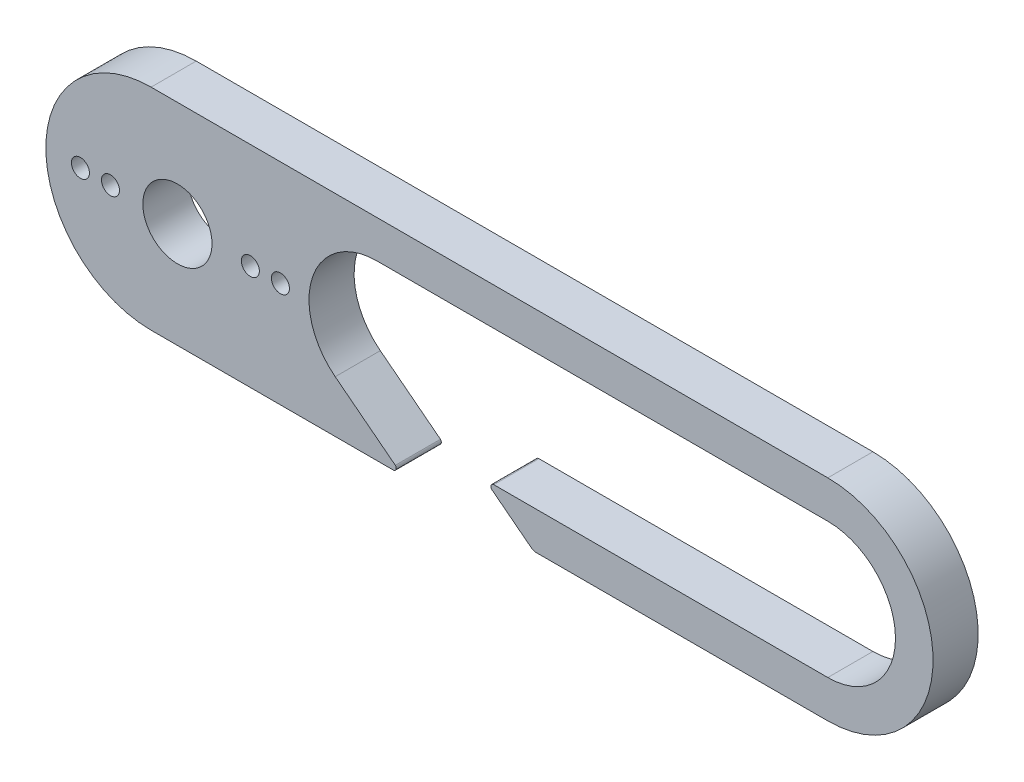
ISO-10303-21;
HEADER;
FILE_DESCRIPTION(('STEP AP214'),'2;1');
FILE_NAME('part.step','',(''),(''),'','','');
FILE_SCHEMA(('AUTOMOTIVE_DESIGN { 1 0 10303 214 1 1 1 1 }'));
ENDSEC;
DATA;
#1=APPLICATION_CONTEXT('core data for automotive mechanical design processes');
#2=APPLICATION_PROTOCOL_DEFINITION('international standard','automotive_design',2000,#1);
#3=PRODUCT_CONTEXT('',#1,'mechanical');
#4=PRODUCT('Part','Part','',(#3));
#5=PRODUCT_RELATED_PRODUCT_CATEGORY('part','',(#4));
#6=PRODUCT_DEFINITION_FORMATION('','',#4);
#7=PRODUCT_DEFINITION_CONTEXT('part definition',#1,'design');
#8=PRODUCT_DEFINITION('design','',#6,#7);
#9=PRODUCT_DEFINITION_SHAPE('','',#8);
#10=(LENGTH_UNIT() NAMED_UNIT(*) SI_UNIT(.MILLI.,.METRE.));
#11=(NAMED_UNIT(*) PLANE_ANGLE_UNIT() SI_UNIT($,.RADIAN.));
#12=(NAMED_UNIT(*) SI_UNIT($,.STERADIAN.) SOLID_ANGLE_UNIT());
#13=UNCERTAINTY_MEASURE_WITH_UNIT(LENGTH_MEASURE(1.E-05),#10,'distance_accuracy_value','');
#14=(GEOMETRIC_REPRESENTATION_CONTEXT(3) GLOBAL_UNCERTAINTY_ASSIGNED_CONTEXT((#13)) GLOBAL_UNIT_ASSIGNED_CONTEXT((#10,
#11,#12)) REPRESENTATION_CONTEXT('',''));
#15=CARTESIAN_POINT('',(0.,0.,0.));
#16=DIRECTION('',(0.,0.,1.));
#17=DIRECTION('',(1.,0.,0.));
#18=AXIS2_PLACEMENT_3D('',#15,#16,#17);
#19=CARTESIAN_POINT('',(0.,6.99999999999997,3.));
#20=DIRECTION('',(0.,1.,0.));
#21=DIRECTION('',(-1.,0.,0.));
#22=AXIS2_PLACEMENT_3D('',#19,#20,#21);
#23=PLANE('',#22);
#24=DIRECTION('',(1.,0.,0.));
#25=VECTOR('',#24,1.);
#26=CARTESIAN_POINT('',(0.,6.99999999999997,0.));
#27=LINE('',#26,#25);
#28=CARTESIAN_POINT('',(1.77037009881857,6.99999999999997,0.));
#29=VERTEX_POINT('',#28);
#30=CARTESIAN_POINT('',(46.7703692680099,7.00000000000002,0.));
#31=VERTEX_POINT('',#30);
#32=EDGE_CURVE('E186',#29,#31,#27,.T.);
#33=ORIENTED_EDGE('',*,*,#32,.F.);
#34=DIRECTION('',(0.,0.,-1.));
#35=VECTOR('',#34,1.);
#36=CARTESIAN_POINT('',(1.77037009881857,6.99999999999997,3.));
#37=LINE('',#36,#35);
#38=CARTESIAN_POINT('',(1.77037009881857,6.99999999999997,3.));
#39=VERTEX_POINT('',#38);
#40=EDGE_CURVE('E11',#39,#29,#37,.T.);
#41=ORIENTED_EDGE('',*,*,#40,.F.);
#42=DIRECTION('',(1.,0.,0.));
#43=VECTOR('',#42,1.);
#44=CARTESIAN_POINT('',(0.,6.99999999999997,3.));
#45=LINE('',#44,#43);
#46=CARTESIAN_POINT('',(46.7703692680099,7.00000000000002,3.));
#47=VERTEX_POINT('',#46);
#48=EDGE_CURVE('E341',#39,#47,#45,.T.);
#49=ORIENTED_EDGE('',*,*,#48,.T.);
#50=DIRECTION('',(0.,0.,-1.));
#51=VECTOR('',#50,1.);
#52=CARTESIAN_POINT('',(46.7703692680099,7.00000000000002,3.));
#53=LINE('',#52,#51);
#54=EDGE_CURVE('E105',#47,#31,#53,.T.);
#55=ORIENTED_EDGE('',*,*,#54,.T.);
#56=EDGE_LOOP('',(#33,#41,#49,#55));
#57=FACE_BOUND('',#56,.T.);
#58=ADVANCED_FACE('F35',(#57),#23,.T.);
#59=CARTESIAN_POINT('',(1.77037009881858,0.,3.));
#60=DIRECTION('',(0.,0.,-1.));
#61=DIRECTION('',(-1.,0.,0.));
#62=AXIS2_PLACEMENT_3D('',#59,#60,#61);
#63=CYLINDRICAL_SURFACE('',#62,6.99999999999997);
#64=CARTESIAN_POINT('',(1.77037009881858,0.,0.));
#65=DIRECTION('',(0.,0.,1.));
#66=DIRECTION('',(1.,0.,0.));
#67=AXIS2_PLACEMENT_3D('',#64,#65,#66);
#68=CIRCLE('',#67,6.99999999999997);
#69=CARTESIAN_POINT('',(1.77037009881858,-6.99999999999997,0.));
#70=VERTEX_POINT('',#69);
#71=EDGE_CURVE('E188',#29,#70,#68,.T.);
#72=ORIENTED_EDGE('',*,*,#71,.T.);
#73=DIRECTION('',(0.,0.,-1.));
#74=VECTOR('',#73,1.);
#75=CARTESIAN_POINT('',(1.77037009881858,-6.99999999999997,3.));
#76=LINE('',#75,#74);
#77=CARTESIAN_POINT('',(1.77037009881858,-6.99999999999997,3.));
#78=VERTEX_POINT('',#77);
#79=EDGE_CURVE('E44',#78,#70,#76,.T.);
#80=ORIENTED_EDGE('',*,*,#79,.F.);
#81=CARTESIAN_POINT('',(1.77037009881858,0.,3.));
#82=DIRECTION('',(0.,0.,1.));
#83=DIRECTION('',(1.,0.,0.));
#84=AXIS2_PLACEMENT_3D('',#81,#82,#83);
#85=CIRCLE('',#84,6.99999999999997);
#86=EDGE_CURVE('E343',#39,#78,#85,.T.);
#87=ORIENTED_EDGE('',*,*,#86,.F.);
#88=ORIENTED_EDGE('',*,*,#40,.T.);
#89=EDGE_LOOP('',(#72,#80,#87,#88));
#90=FACE_BOUND('',#89,.T.);
#91=ADVANCED_FACE('F264',(#90),#63,.T.);
#92=CARTESIAN_POINT('',(0.,-6.99999999999997,3.));
#93=DIRECTION('',(0.,1.,0.));
#94=DIRECTION('',(-1.,0.,0.));
#95=AXIS2_PLACEMENT_3D('',#92,#93,#94);
#96=PLANE('',#95);
#97=DIRECTION('',(1.,0.,0.));
#98=VECTOR('',#97,1.);
#99=CARTESIAN_POINT('',(0.,-6.99999999999997,0.));
#100=LINE('',#99,#98);
#101=CARTESIAN_POINT('',(17.8715976238939,-7.,0.));
#102=VERTEX_POINT('',#101);
#103=EDGE_CURVE('E191',#70,#102,#100,.T.);
#104=ORIENTED_EDGE('',*,*,#103,.T.);
#105=DIRECTION('',(0.,0.,-1.));
#106=VECTOR('',#105,1.);
#107=CARTESIAN_POINT('',(17.8715976238939,-7.,3.));
#108=LINE('',#107,#106);
#109=CARTESIAN_POINT('',(17.8715976238939,-7.,3.));
#110=VERTEX_POINT('',#109);
#111=EDGE_CURVE('E252',#110,#102,#108,.T.);
#112=ORIENTED_EDGE('',*,*,#111,.F.);
#113=DIRECTION('',(1.,0.,0.));
#114=VECTOR('',#113,1.);
#115=CARTESIAN_POINT('',(0.,-6.99999999999997,3.));
#116=LINE('',#115,#114);
#117=EDGE_CURVE('E260',#78,#110,#116,.T.);
#118=ORIENTED_EDGE('',*,*,#117,.F.);
#119=ORIENTED_EDGE('',*,*,#79,.T.);
#120=EDGE_LOOP('',(#104,#112,#118,#119));
#121=FACE_BOUND('',#120,.T.);
#122=ADVANCED_FACE('F257',(#121),#96,.F.);
#123=CARTESIAN_POINT('',(17.8715976238939,-6.80000000000001,3.));
#124=DIRECTION('',(0.,0.,-1.));
#125=DIRECTION('',(-1.,0.,0.));
#126=AXIS2_PLACEMENT_3D('',#123,#124,#125);
#127=CYLINDRICAL_SURFACE('',#126,0.2);
#128=CARTESIAN_POINT('',(17.8715976238939,-6.80000000000001,0.));
#129=DIRECTION('',(0.,0.,1.));
#130=DIRECTION('',(1.,0.,0.));
#131=AXIS2_PLACEMENT_3D('',#128,#129,#130);
#132=CIRCLE('',#131,0.2);
#133=CARTESIAN_POINT('',(18.0106426469817,-6.65624158614355,0.));
#134=VERTEX_POINT('',#133);
#135=EDGE_CURVE('E194',#102,#134,#132,.T.);
#136=ORIENTED_EDGE('',*,*,#135,.T.);
#137=DIRECTION('',(0.,0.,-1.));
#138=VECTOR('',#137,1.);
#139=CARTESIAN_POINT('',(18.0106426469817,-6.65624158614355,3.));
#140=LINE('',#139,#138);
#141=CARTESIAN_POINT('',(18.0106426469817,-6.65624158614355,3.));
#142=VERTEX_POINT('',#141);
#143=EDGE_CURVE('E250',#142,#134,#140,.T.);
#144=ORIENTED_EDGE('',*,*,#143,.F.);
#145=CARTESIAN_POINT('',(17.8715976238939,-6.80000000000001,3.));
#146=DIRECTION('',(0.,0.,1.));
#147=DIRECTION('',(1.,0.,0.));
#148=AXIS2_PLACEMENT_3D('',#145,#146,#147);
#149=CIRCLE('',#148,0.2);
#150=EDGE_CURVE('E348',#110,#142,#149,.T.);
#151=ORIENTED_EDGE('',*,*,#150,.F.);
#152=ORIENTED_EDGE('',*,*,#111,.T.);
#153=EDGE_LOOP('',(#136,#144,#151,#152));
#154=FACE_BOUND('',#153,.T.);
#155=ADVANCED_FACE('F275',(#154),#127,.T.);
#156=CARTESIAN_POINT('',(3.54001272752742,4.56507894489786,3.));
#157=DIRECTION('',(0.612796216560083,0.790240973988091,0.));
#158=DIRECTION('',(-0.790240973988091,0.612796216560083,0.));
#159=AXIS2_PLACEMENT_3D('',#156,#157,#158);
#160=PLANE('',#159);
#161=DIRECTION('',(0.790240973988091,-0.612796216560083,0.));
#162=VECTOR('',#161,1.);
#163=CARTESIAN_POINT('',(3.54001272752742,4.56507894489786,0.));
#164=LINE('',#163,#162);
#165=CARTESIAN_POINT('',(14.0127862934895,-3.55608438294641,0.));
#166=VERTEX_POINT('',#165);
#167=EDGE_CURVE('E197',#166,#134,#164,.T.);
#168=ORIENTED_EDGE('',*,*,#167,.F.);
#169=DIRECTION('',(0.,0.,-1.));
#170=VECTOR('',#169,1.);
#171=CARTESIAN_POINT('',(14.0127862934895,-3.55608438294641,3.));
#172=LINE('',#171,#170);
#173=CARTESIAN_POINT('',(14.0127862934895,-3.55608438294641,3.));
#174=VERTEX_POINT('',#173);
#175=EDGE_CURVE('E248',#174,#166,#172,.T.);
#176=ORIENTED_EDGE('',*,*,#175,.F.);
#177=DIRECTION('',(0.790240973988091,-0.612796216560083,0.));
#178=VECTOR('',#177,1.);
#179=CARTESIAN_POINT('',(3.54001272752742,4.56507894489786,3.));
#180=LINE('',#179,#178);
#181=EDGE_CURVE('E350',#174,#142,#180,.T.);
#182=ORIENTED_EDGE('',*,*,#181,.T.);
#183=ORIENTED_EDGE('',*,*,#143,.T.);
#184=EDGE_LOOP('',(#168,#176,#182,#183));
#185=FACE_BOUND('',#184,.T.);
#186=ADVANCED_FACE('F278',(#185),#160,.T.);
#187=CARTESIAN_POINT('',(16.7703692680099,0.,3.));
#188=DIRECTION('',(0.,0.,-1.));
#189=DIRECTION('',(-1.,0.,0.));
#190=AXIS2_PLACEMENT_3D('',#187,#188,#189);
#191=CYLINDRICAL_SURFACE('',#190,4.5);
#192=CARTESIAN_POINT('',(16.7703692680099,0.,0.));
#193=DIRECTION('',(0.,0.,1.));
#194=DIRECTION('',(1.,0.,0.));
#195=AXIS2_PLACEMENT_3D('',#192,#193,#194);
#196=CIRCLE('',#195,4.5);
#197=CARTESIAN_POINT('',(16.7703692680099,4.5,0.));
#198=VERTEX_POINT('',#197);
#199=EDGE_CURVE('E200',#198,#166,#196,.T.);
#200=ORIENTED_EDGE('',*,*,#199,.F.);
#201=DIRECTION('',(0.,0.,-1.));
#202=VECTOR('',#201,1.);
#203=CARTESIAN_POINT('',(16.7703692680099,4.5,3.));
#204=LINE('',#203,#202);
#205=CARTESIAN_POINT('',(16.7703692680099,4.5,3.));
#206=VERTEX_POINT('',#205);
#207=EDGE_CURVE('E246',#206,#198,#204,.T.);
#208=ORIENTED_EDGE('',*,*,#207,.F.);
#209=CARTESIAN_POINT('',(16.7703692680099,0.,3.));
#210=DIRECTION('',(0.,0.,1.));
#211=DIRECTION('',(1.,0.,0.));
#212=AXIS2_PLACEMENT_3D('',#209,#210,#211);
#213=CIRCLE('',#212,4.5);
#214=EDGE_CURVE('E353',#206,#174,#213,.T.);
#215=ORIENTED_EDGE('',*,*,#214,.T.);
#216=ORIENTED_EDGE('',*,*,#175,.T.);
#217=EDGE_LOOP('',(#200,#208,#215,#216));
#218=FACE_BOUND('',#217,.T.);
#219=ADVANCED_FACE('F282',(#218),#191,.F.);
#220=CARTESIAN_POINT('',(0.,4.5,3.));
#221=DIRECTION('',(0.,1.,0.));
#222=DIRECTION('',(-1.,0.,0.));
#223=AXIS2_PLACEMENT_3D('',#220,#221,#222);
#224=PLANE('',#223);
#225=DIRECTION('',(1.,0.,0.));
#226=VECTOR('',#225,1.);
#227=CARTESIAN_POINT('',(0.,4.5,0.));
#228=LINE('',#227,#226);
#229=CARTESIAN_POINT('',(46.7703692680099,4.50000000000001,0.));
#230=VERTEX_POINT('',#229);
#231=EDGE_CURVE('E203',#198,#230,#228,.T.);
#232=ORIENTED_EDGE('',*,*,#231,.T.);
#233=DIRECTION('',(0.,0.,-1.));
#234=VECTOR('',#233,1.);
#235=CARTESIAN_POINT('',(46.7703692680099,4.50000000000001,3.));
#236=LINE('',#235,#234);
#237=CARTESIAN_POINT('',(46.7703692680099,4.50000000000001,3.));
#238=VERTEX_POINT('',#237);
#239=EDGE_CURVE('E244',#238,#230,#236,.T.);
#240=ORIENTED_EDGE('',*,*,#239,.F.);
#241=DIRECTION('',(1.,0.,0.));
#242=VECTOR('',#241,1.);
#243=CARTESIAN_POINT('',(0.,4.5,3.));
#244=LINE('',#243,#242);
#245=EDGE_CURVE('E356',#206,#238,#244,.T.);
#246=ORIENTED_EDGE('',*,*,#245,.F.);
#247=ORIENTED_EDGE('',*,*,#207,.T.);
#248=EDGE_LOOP('',(#232,#240,#246,#247));
#249=FACE_BOUND('',#248,.T.);
#250=ADVANCED_FACE('F286',(#249),#224,.F.);
#251=CARTESIAN_POINT('',(46.7703700988186,0.,3.));
#252=DIRECTION('',(0.,0.,-1.));
#253=DIRECTION('',(-1.,0.,0.));
#254=AXIS2_PLACEMENT_3D('',#251,#252,#253);
#255=CYLINDRICAL_SURFACE('',#254,4.50000000000009);
#256=CARTESIAN_POINT('',(46.7703700988186,0.,0.));
#257=DIRECTION('',(0.,0.,1.));
#258=DIRECTION('',(1.,0.,0.));
#259=AXIS2_PLACEMENT_3D('',#256,#257,#258);
#260=CIRCLE('',#259,4.50000000000009);
#261=CARTESIAN_POINT('',(46.7703692680099,-4.50000000000001,0.));
#262=VERTEX_POINT('',#261);
#263=EDGE_CURVE('E206',#262,#230,#260,.T.);
#264=ORIENTED_EDGE('',*,*,#263,.F.);
#265=DIRECTION('',(0.,0.,-1.));
#266=VECTOR('',#265,1.);
#267=CARTESIAN_POINT('',(46.7703692680099,-4.50000000000001,3.));
#268=LINE('',#267,#266);
#269=CARTESIAN_POINT('',(46.7703692680099,-4.50000000000001,3.));
#270=VERTEX_POINT('',#269);
#271=EDGE_CURVE('E242',#270,#262,#268,.T.);
#272=ORIENTED_EDGE('',*,*,#271,.F.);
#273=CARTESIAN_POINT('',(46.7703700988186,0.,3.));
#274=DIRECTION('',(0.,0.,1.));
#275=DIRECTION('',(1.,0.,0.));
#276=AXIS2_PLACEMENT_3D('',#273,#274,#275);
#277=CIRCLE('',#276,4.50000000000009);
#278=EDGE_CURVE('E358',#270,#238,#277,.T.);
#279=ORIENTED_EDGE('',*,*,#278,.T.);
#280=ORIENTED_EDGE('',*,*,#239,.T.);
#281=EDGE_LOOP('',(#264,#272,#279,#280));
#282=FACE_BOUND('',#281,.T.);
#283=ADVANCED_FACE('F290',(#282),#255,.F.);
#284=CARTESIAN_POINT('',(0.,-4.49999999999994,3.));
#285=DIRECTION('',(0.,1.,0.));
#286=DIRECTION('',(-1.,0.,0.));
#287=AXIS2_PLACEMENT_3D('',#284,#285,#286);
#288=PLANE('',#287);
#289=DIRECTION('',(1.,0.,0.));
#290=VECTOR('',#289,1.);
#291=CARTESIAN_POINT('',(0.,-4.49999999999994,0.));
#292=LINE('',#291,#290);
#293=CARTESIAN_POINT('',(24.5608202290082,-4.49999999999998,0.));
#294=VERTEX_POINT('',#293);
#295=EDGE_CURVE('E209',#294,#262,#292,.T.);
#296=ORIENTED_EDGE('',*,*,#295,.F.);
#297=DIRECTION('',(0.,0.,-1.));
#298=VECTOR('',#297,1.);
#299=CARTESIAN_POINT('',(24.5608202290082,-4.49999999999998,3.));
#300=LINE('',#299,#298);
#301=CARTESIAN_POINT('',(24.5608202290082,-4.49999999999998,3.));
#302=VERTEX_POINT('',#301);
#303=EDGE_CURVE('E240',#302,#294,#300,.T.);
#304=ORIENTED_EDGE('',*,*,#303,.F.);
#305=DIRECTION('',(1.,0.,0.));
#306=VECTOR('',#305,1.);
#307=CARTESIAN_POINT('',(0.,-4.49999999999994,3.));
#308=LINE('',#307,#306);
#309=EDGE_CURVE('E361',#302,#270,#308,.T.);
#310=ORIENTED_EDGE('',*,*,#309,.T.);
#311=ORIENTED_EDGE('',*,*,#271,.T.);
#312=EDGE_LOOP('',(#296,#304,#310,#311));
#313=FACE_BOUND('',#312,.T.);
#314=ADVANCED_FACE('F294',(#313),#288,.T.);
#315=CARTESIAN_POINT('',(24.5608202290082,-4.69999999999998,3.));
#316=DIRECTION('',(0.,0.,-1.));
#317=DIRECTION('',(-1.,0.,0.));
#318=AXIS2_PLACEMENT_3D('',#315,#316,#317);
#319=CYLINDRICAL_SURFACE('',#318,0.199999999999999);
#320=CARTESIAN_POINT('',(24.5608202290082,-4.69999999999998,0.));
#321=DIRECTION('',(0.,0.,1.));
#322=DIRECTION('',(1.,0.,0.));
#323=AXIS2_PLACEMENT_3D('',#320,#321,#322);
#324=CIRCLE('',#323,0.199999999999999);
#325=CARTESIAN_POINT('',(24.4382609856962,-4.85804819479759,0.));
#326=VERTEX_POINT('',#325);
#327=EDGE_CURVE('E212',#326,#294,#324,.F.);
#328=ORIENTED_EDGE('',*,*,#327,.F.);
#329=DIRECTION('',(0.,0.,-1.));
#330=VECTOR('',#329,1.);
#331=CARTESIAN_POINT('',(24.4382609856962,-4.85804819479759,3.));
#332=LINE('',#331,#330);
#333=CARTESIAN_POINT('',(24.4382609856962,-4.85804819479759,3.));
#334=VERTEX_POINT('',#333);
#335=EDGE_CURVE('E238',#334,#326,#332,.T.);
#336=ORIENTED_EDGE('',*,*,#335,.F.);
#337=CARTESIAN_POINT('',(24.5608202290082,-4.69999999999998,3.));
#338=DIRECTION('',(0.,0.,1.));
#339=DIRECTION('',(1.,0.,0.));
#340=AXIS2_PLACEMENT_3D('',#337,#338,#339);
#341=CIRCLE('',#340,0.199999999999999);
#342=EDGE_CURVE('E166',#334,#302,#341,.F.);
#343=ORIENTED_EDGE('',*,*,#342,.T.);
#344=ORIENTED_EDGE('',*,*,#303,.T.);
#345=EDGE_LOOP('',(#328,#336,#343,#344));
#346=FACE_BOUND('',#345,.T.);
#347=ADVANCED_FACE('F298',(#346),#319,.T.);
#348=CARTESIAN_POINT('',(6.82449400341283,8.80063329781357,3.));
#349=DIRECTION('',(-0.612796216560084,-0.790240973988091,0.));
#350=DIRECTION('',(0.790240973988091,-0.612796216560084,0.));
#351=AXIS2_PLACEMENT_3D('',#348,#349,#350);
#352=PLANE('',#351);
#353=DIRECTION('',(-0.790240973988091,0.612796216560084,0.));
#354=VECTOR('',#353,1.);
#355=CARTESIAN_POINT('',(6.82449400341283,8.80063329781357,0.));
#356=LINE('',#355,#354);
#357=CARTESIAN_POINT('',(27.0651995156139,-6.89512048699405,0.));
#358=VERTEX_POINT('',#357);
#359=EDGE_CURVE('E215',#358,#326,#356,.T.);
#360=ORIENTED_EDGE('',*,*,#359,.F.);
#361=DIRECTION('',(0.,0.,-1.));
#362=VECTOR('',#361,1.);
#363=CARTESIAN_POINT('',(27.0651995156139,-6.89512048699405,3.));
#364=LINE('',#363,#362);
#365=CARTESIAN_POINT('',(27.0651995156139,-6.89512048699405,3.));
#366=VERTEX_POINT('',#365);
#367=EDGE_CURVE('E152',#366,#358,#364,.T.);
#368=ORIENTED_EDGE('',*,*,#367,.F.);
#369=DIRECTION('',(-0.790240973988091,0.612796216560084,0.));
#370=VECTOR('',#369,1.);
#371=CARTESIAN_POINT('',(6.82449400341283,8.80063329781357,3.));
#372=LINE('',#371,#370);
#373=EDGE_CURVE('E164',#366,#334,#372,.T.);
#374=ORIENTED_EDGE('',*,*,#373,.T.);
#375=ORIENTED_EDGE('',*,*,#335,.T.);
#376=EDGE_LOOP('',(#360,#368,#374,#375));
#377=FACE_BOUND('',#376,.T.);
#378=ADVANCED_FACE('F302',(#377),#352,.T.);
#379=CARTESIAN_POINT('',(27.3715976238939,-6.50000000000001,3.));
#380=DIRECTION('',(0.,0.,-1.));
#381=DIRECTION('',(-1.,0.,0.));
#382=AXIS2_PLACEMENT_3D('',#379,#380,#381);
#383=CYLINDRICAL_SURFACE('',#382,0.5);
#384=CARTESIAN_POINT('',(27.3715976238939,-6.50000000000001,0.));
#385=DIRECTION('',(0.,0.,1.));
#386=DIRECTION('',(1.,0.,0.));
#387=AXIS2_PLACEMENT_3D('',#384,#385,#386);
#388=CIRCLE('',#387,0.5);
#389=CARTESIAN_POINT('',(27.3715976238939,-7.00000000000001,0.));
#390=VERTEX_POINT('',#389);
#391=EDGE_CURVE('E149',#390,#358,#388,.F.);
#392=ORIENTED_EDGE('',*,*,#391,.F.);
#393=DIRECTION('',(0.,0.,-1.));
#394=VECTOR('',#393,1.);
#395=CARTESIAN_POINT('',(27.3715976238939,-7.00000000000001,3.));
#396=LINE('',#395,#394);
#397=CARTESIAN_POINT('',(27.3715976238939,-7.00000000000001,3.));
#398=VERTEX_POINT('',#397);
#399=EDGE_CURVE('E143',#398,#390,#396,.T.);
#400=ORIENTED_EDGE('',*,*,#399,.F.);
#401=CARTESIAN_POINT('',(27.3715976238939,-6.50000000000001,3.));
#402=DIRECTION('',(0.,0.,1.));
#403=DIRECTION('',(1.,0.,0.));
#404=AXIS2_PLACEMENT_3D('',#401,#402,#403);
#405=CIRCLE('',#404,0.5);
#406=EDGE_CURVE('E147',#398,#366,#405,.F.);
#407=ORIENTED_EDGE('',*,*,#406,.T.);
#408=ORIENTED_EDGE('',*,*,#367,.T.);
#409=EDGE_LOOP('',(#392,#400,#407,#408));
#410=FACE_BOUND('',#409,.T.);
#411=ADVANCED_FACE('F145',(#410),#383,.T.);
#412=CARTESIAN_POINT('',(0.,-7.00000000000019,3.));
#413=DIRECTION('',(0.,1.,0.));
#414=DIRECTION('',(-1.,0.,0.));
#415=AXIS2_PLACEMENT_3D('',#412,#413,#414);
#416=PLANE('',#415);
#417=DIRECTION('',(1.,0.,0.));
#418=VECTOR('',#417,1.);
#419=CARTESIAN_POINT('',(0.,-7.00000000000019,0.));
#420=LINE('',#419,#418);
#421=CARTESIAN_POINT('',(46.7703688064495,-6.99999999999988,0.));
#422=VERTEX_POINT('',#421);
#423=EDGE_CURVE('E219',#390,#422,#420,.T.);
#424=ORIENTED_EDGE('',*,*,#423,.T.);
#425=DIRECTION('',(0.,0.,-1.));
#426=VECTOR('',#425,1.);
#427=CARTESIAN_POINT('',(46.7703688064495,-6.99999999999988,3.));
#428=LINE('',#427,#426);
#429=CARTESIAN_POINT('',(46.7703688064495,-6.99999999999988,3.));
#430=VERTEX_POINT('',#429);
#431=EDGE_CURVE('E153',#430,#422,#428,.T.);
#432=ORIENTED_EDGE('',*,*,#431,.F.);
#433=DIRECTION('',(1.,0.,0.));
#434=VECTOR('',#433,1.);
#435=CARTESIAN_POINT('',(0.,-7.00000000000019,3.));
#436=LINE('',#435,#434);
#437=EDGE_CURVE('E156',#398,#430,#436,.T.);
#438=ORIENTED_EDGE('',*,*,#437,.F.);
#439=ORIENTED_EDGE('',*,*,#399,.T.);
#440=EDGE_LOOP('',(#424,#432,#438,#439));
#441=FACE_BOUND('',#440,.T.);
#442=ADVANCED_FACE('F157',(#441),#416,.F.);
#443=CARTESIAN_POINT('',(10.3703696834142,0.,3.));
#444=DIRECTION('',(0.,0.,-1.));
#445=DIRECTION('',(-1.,0.,0.));
#446=AXIS2_PLACEMENT_3D('',#443,#444,#445);
#447=CYLINDRICAL_SURFACE('',#446,0.600000000000011);
#448=CARTESIAN_POINT('',(10.3703696834142,0.,3.));
#449=DIRECTION('',(0.,0.,1.));
#450=DIRECTION('',(1.,0.,0.));
#451=AXIS2_PLACEMENT_3D('',#448,#449,#450);
#452=CIRCLE('',#451,0.600000000000011);
#453=CARTESIAN_POINT('',(10.9703696834143,0.,3.));
#454=VERTEX_POINT('',#453);
#455=EDGE_CURVE('E177',#454,#454,#452,.T.);
#456=ORIENTED_EDGE('',*,*,#455,.T.);
#457=EDGE_LOOP('',(#456));
#458=FACE_BOUND('',#457,.T.);
#459=CARTESIAN_POINT('',(10.3703696834142,0.,0.));
#460=DIRECTION('',(0.,0.,1.));
#461=DIRECTION('',(1.,0.,0.));
#462=AXIS2_PLACEMENT_3D('',#459,#460,#461);
#463=CIRCLE('',#462,0.600000000000011);
#464=CARTESIAN_POINT('',(10.9703696834143,0.,0.));
#465=VERTEX_POINT('',#464);
#466=EDGE_CURVE('E228',#465,#465,#463,.T.);
#467=ORIENTED_EDGE('',*,*,#466,.F.);
#468=EDGE_LOOP('',(#467));
#469=FACE_BOUND('',#468,.T.);
#470=ADVANCED_FACE('F311',(#458,#469),#447,.F.);
#471=CARTESIAN_POINT('',(-0.929630316585765,0.,3.));
#472=DIRECTION('',(0.,0.,-1.));
#473=DIRECTION('',(-1.,0.,0.));
#474=AXIS2_PLACEMENT_3D('',#471,#472,#473);
#475=CYLINDRICAL_SURFACE('',#474,0.600000000000013);
#476=CARTESIAN_POINT('',(-0.929630316585765,0.,3.));
#477=DIRECTION('',(0.,0.,1.));
#478=DIRECTION('',(1.,0.,0.));
#479=AXIS2_PLACEMENT_3D('',#476,#477,#478);
#480=CIRCLE('',#479,0.600000000000013);
#481=CARTESIAN_POINT('',(-0.329630316585752,0.,3.));
#482=VERTEX_POINT('',#481);
#483=EDGE_CURVE('E174',#482,#482,#480,.T.);
#484=ORIENTED_EDGE('',*,*,#483,.T.);
#485=EDGE_LOOP('',(#484));
#486=FACE_BOUND('',#485,.T.);
#487=CARTESIAN_POINT('',(-0.929630316585765,0.,0.));
#488=DIRECTION('',(0.,0.,1.));
#489=DIRECTION('',(1.,0.,0.));
#490=AXIS2_PLACEMENT_3D('',#487,#488,#489);
#491=CIRCLE('',#490,0.600000000000013);
#492=CARTESIAN_POINT('',(-0.329630316585752,0.,0.));
#493=VERTEX_POINT('',#492);
#494=EDGE_CURVE('E225',#493,#493,#491,.T.);
#495=ORIENTED_EDGE('',*,*,#494,.F.);
#496=EDGE_LOOP('',(#495));
#497=FACE_BOUND('',#496,.T.);
#498=ADVANCED_FACE('F319',(#486,#497),#475,.F.);
#499=CARTESIAN_POINT('',(-2.92963031658576,0.,3.));
#500=DIRECTION('',(0.,0.,-1.));
#501=DIRECTION('',(-1.,0.,0.));
#502=AXIS2_PLACEMENT_3D('',#499,#500,#501);
#503=CYLINDRICAL_SURFACE('',#502,0.600000000000015);
#504=CARTESIAN_POINT('',(-2.92963031658576,0.,3.));
#505=DIRECTION('',(0.,0.,1.));
#506=DIRECTION('',(1.,0.,0.));
#507=AXIS2_PLACEMENT_3D('',#504,#505,#506);
#508=CIRCLE('',#507,0.600000000000015);
#509=CARTESIAN_POINT('',(-2.32963031658575,0.,3.));
#510=VERTEX_POINT('',#509);
#511=EDGE_CURVE('E171',#510,#510,#508,.T.);
#512=ORIENTED_EDGE('',*,*,#511,.T.);
#513=EDGE_LOOP('',(#512));
#514=FACE_BOUND('',#513,.T.);
#515=CARTESIAN_POINT('',(-2.92963031658576,0.,0.));
#516=DIRECTION('',(0.,0.,1.));
#517=DIRECTION('',(1.,0.,0.));
#518=AXIS2_PLACEMENT_3D('',#515,#516,#517);
#519=CIRCLE('',#518,0.600000000000015);
#520=CARTESIAN_POINT('',(-2.32963031658575,0.,0.));
#521=VERTEX_POINT('',#520);
#522=EDGE_CURVE('E222',#521,#521,#519,.T.);
#523=ORIENTED_EDGE('',*,*,#522,.F.);
#524=EDGE_LOOP('',(#523));
#525=FACE_BOUND('',#524,.T.);
#526=ADVANCED_FACE('F315',(#514,#525),#503,.F.);
#527=CARTESIAN_POINT('',(46.7703700988186,0.,3.));
#528=DIRECTION('',(0.,0.,-1.));
#529=DIRECTION('',(-1.,0.,0.));
#530=AXIS2_PLACEMENT_3D('',#527,#528,#529);
#531=CYLINDRICAL_SURFACE('',#530,7.00000000000003);
#532=CARTESIAN_POINT('',(46.7703700988186,0.,0.));
#533=DIRECTION('',(0.,0.,1.));
#534=DIRECTION('',(1.,0.,0.));
#535=AXIS2_PLACEMENT_3D('',#532,#533,#534);
#536=CIRCLE('',#535,7.00000000000003);
#537=EDGE_CURVE('E98',#422,#31,#536,.T.);
#538=ORIENTED_EDGE('',*,*,#537,.T.);
#539=ORIENTED_EDGE('',*,*,#54,.F.);
#540=CARTESIAN_POINT('',(46.7703700988186,0.,3.));
#541=DIRECTION('',(0.,0.,1.));
#542=DIRECTION('',(1.,0.,0.));
#543=AXIS2_PLACEMENT_3D('',#540,#541,#542);
#544=CIRCLE('',#543,7.00000000000003);
#545=EDGE_CURVE('E52',#430,#47,#544,.T.);
#546=ORIENTED_EDGE('',*,*,#545,.F.);
#547=ORIENTED_EDGE('',*,*,#431,.T.);
#548=EDGE_LOOP('',(#538,#539,#546,#547));
#549=FACE_BOUND('',#548,.T.);
#550=ADVANCED_FACE('F312',(#549),#531,.T.);
#551=CARTESIAN_POINT('',(3.52036968341423,0.,3.));
#552=DIRECTION('',(0.,0.,-1.));
#553=DIRECTION('',(-1.,0.,0.));
#554=AXIS2_PLACEMENT_3D('',#551,#552,#553);
#555=CYLINDRICAL_SURFACE('',#554,2.30000000000001);
#556=CARTESIAN_POINT('',(3.52036968341423,0.,3.));
#557=DIRECTION('',(0.,0.,1.));
#558=DIRECTION('',(1.,0.,0.));
#559=AXIS2_PLACEMENT_3D('',#556,#557,#558);
#560=CIRCLE('',#559,2.30000000000001);
#561=CARTESIAN_POINT('',(5.82036968341425,0.,3.));
#562=VERTEX_POINT('',#561);
#563=EDGE_CURVE('E234',#562,#562,#560,.T.);
#564=ORIENTED_EDGE('',*,*,#563,.T.);
#565=EDGE_LOOP('',(#564));
#566=FACE_BOUND('',#565,.T.);
#567=CARTESIAN_POINT('',(3.52036968341423,0.,0.));
#568=DIRECTION('',(0.,0.,1.));
#569=DIRECTION('',(1.,0.,0.));
#570=AXIS2_PLACEMENT_3D('',#567,#568,#569);
#571=CIRCLE('',#570,2.30000000000001);
#572=CARTESIAN_POINT('',(5.82036968341425,0.,0.));
#573=VERTEX_POINT('',#572);
#574=EDGE_CURVE('E183',#573,#573,#571,.T.);
#575=ORIENTED_EDGE('',*,*,#574,.F.);
#576=EDGE_LOOP('',(#575));
#577=FACE_BOUND('',#576,.T.);
#578=ADVANCED_FACE('F37',(#566,#577),#555,.F.);
#579=CARTESIAN_POINT('',(8.37036968341424,0.,3.));
#580=DIRECTION('',(0.,0.,-1.));
#581=DIRECTION('',(-1.,0.,0.));
#582=AXIS2_PLACEMENT_3D('',#579,#580,#581);
#583=CYLINDRICAL_SURFACE('',#582,0.600000000000013);
#584=CARTESIAN_POINT('',(8.37036968341424,0.,3.));
#585=DIRECTION('',(0.,0.,1.));
#586=DIRECTION('',(1.,0.,0.));
#587=AXIS2_PLACEMENT_3D('',#584,#585,#586);
#588=CIRCLE('',#587,0.600000000000013);
#589=CARTESIAN_POINT('',(8.97036968341426,0.,3.));
#590=VERTEX_POINT('',#589);
#591=EDGE_CURVE('E180',#590,#590,#588,.T.);
#592=ORIENTED_EDGE('',*,*,#591,.T.);
#593=EDGE_LOOP('',(#592));
#594=FACE_BOUND('',#593,.T.);
#595=CARTESIAN_POINT('',(8.37036968341424,0.,0.));
#596=DIRECTION('',(0.,0.,1.));
#597=DIRECTION('',(1.,0.,0.));
#598=AXIS2_PLACEMENT_3D('',#595,#596,#597);
#599=CIRCLE('',#598,0.600000000000013);
#600=CARTESIAN_POINT('',(8.97036968341426,0.,0.));
#601=VERTEX_POINT('',#600);
#602=EDGE_CURVE('E231',#601,#601,#599,.T.);
#603=ORIENTED_EDGE('',*,*,#602,.F.);
#604=EDGE_LOOP('',(#603));
#605=FACE_BOUND('',#604,.T.);
#606=ADVANCED_FACE('F327',(#594,#605),#583,.F.);
#607=CARTESIAN_POINT('',(0.,0.,3.));
#608=DIRECTION('',(0.,0.,1.));
#609=DIRECTION('',(1.,0.,0.));
#610=AXIS2_PLACEMENT_3D('',#607,#608,#609);
#611=PLANE('',#610);
#612=ORIENTED_EDGE('',*,*,#563,.F.);
#613=EDGE_LOOP('',(#612));
#614=FACE_BOUND('',#613,.T.);
#615=ORIENTED_EDGE('',*,*,#48,.F.);
#616=ORIENTED_EDGE('',*,*,#86,.T.);
#617=ORIENTED_EDGE('',*,*,#117,.T.);
#618=ORIENTED_EDGE('',*,*,#150,.T.);
#619=ORIENTED_EDGE('',*,*,#181,.F.);
#620=ORIENTED_EDGE('',*,*,#214,.F.);
#621=ORIENTED_EDGE('',*,*,#245,.T.);
#622=ORIENTED_EDGE('',*,*,#278,.F.);
#623=ORIENTED_EDGE('',*,*,#309,.F.);
#624=ORIENTED_EDGE('',*,*,#342,.F.);
#625=ORIENTED_EDGE('',*,*,#373,.F.);
#626=ORIENTED_EDGE('',*,*,#406,.F.);
#627=ORIENTED_EDGE('',*,*,#437,.T.);
#628=ORIENTED_EDGE('',*,*,#545,.T.);
#629=EDGE_LOOP('',(#615,#616,#617,#618,#619,#620,#621,#622,#623,#624,#625,#626,#627,#628));
#630=FACE_BOUND('',#629,.T.);
#631=ORIENTED_EDGE('',*,*,#511,.F.);
#632=EDGE_LOOP('',(#631));
#633=FACE_BOUND('',#632,.T.);
#634=ORIENTED_EDGE('',*,*,#483,.F.);
#635=EDGE_LOOP('',(#634));
#636=FACE_BOUND('',#635,.T.);
#637=ORIENTED_EDGE('',*,*,#455,.F.);
#638=EDGE_LOOP('',(#637));
#639=FACE_BOUND('',#638,.T.);
#640=ORIENTED_EDGE('',*,*,#591,.F.);
#641=EDGE_LOOP('',(#640));
#642=FACE_BOUND('',#641,.T.);
#643=ADVANCED_FACE('F160',(#614,#630,#633,#636,#639,#642),#611,.T.);
#644=CARTESIAN_POINT('',(0.,0.,0.));
#645=DIRECTION('',(0.,0.,1.));
#646=DIRECTION('',(1.,0.,0.));
#647=AXIS2_PLACEMENT_3D('',#644,#645,#646);
#648=PLANE('',#647);
#649=ORIENTED_EDGE('',*,*,#574,.T.);
#650=EDGE_LOOP('',(#649));
#651=FACE_BOUND('',#650,.T.);
#652=ORIENTED_EDGE('',*,*,#32,.T.);
#653=ORIENTED_EDGE('',*,*,#537,.F.);
#654=ORIENTED_EDGE('',*,*,#423,.F.);
#655=ORIENTED_EDGE('',*,*,#391,.T.);
#656=ORIENTED_EDGE('',*,*,#359,.T.);
#657=ORIENTED_EDGE('',*,*,#327,.T.);
#658=ORIENTED_EDGE('',*,*,#295,.T.);
#659=ORIENTED_EDGE('',*,*,#263,.T.);
#660=ORIENTED_EDGE('',*,*,#231,.F.);
#661=ORIENTED_EDGE('',*,*,#199,.T.);
#662=ORIENTED_EDGE('',*,*,#167,.T.);
#663=ORIENTED_EDGE('',*,*,#135,.F.);
#664=ORIENTED_EDGE('',*,*,#103,.F.);
#665=ORIENTED_EDGE('',*,*,#71,.F.);
#666=EDGE_LOOP('',(#652,#653,#654,#655,#656,#657,#658,#659,#660,#661,#662,#663,#664,#665));
#667=FACE_BOUND('',#666,.T.);
#668=ORIENTED_EDGE('',*,*,#522,.T.);
#669=EDGE_LOOP('',(#668));
#670=FACE_BOUND('',#669,.T.);
#671=ORIENTED_EDGE('',*,*,#494,.T.);
#672=EDGE_LOOP('',(#671));
#673=FACE_BOUND('',#672,.T.);
#674=ORIENTED_EDGE('',*,*,#466,.T.);
#675=EDGE_LOOP('',(#674));
#676=FACE_BOUND('',#675,.T.);
#677=ORIENTED_EDGE('',*,*,#602,.T.);
#678=EDGE_LOOP('',(#677));
#679=FACE_BOUND('',#678,.T.);
#680=ADVANCED_FACE('F265',(#651,#667,#670,#673,#676,#679),#648,.F.);
#681=CLOSED_SHELL('',(#58,#91,#122,#155,#186,#219,#250,#283,#314,#347,#378,#411,#442,#470,#498,
#526,#550,#578,#606,#643,#680));
#682=MANIFOLD_SOLID_BREP('B2',#681);
#683=ADVANCED_BREP_SHAPE_REPRESENTATION('',(#18,#682),#14);
#684=SHAPE_DEFINITION_REPRESENTATION(#9,#683);
ENDSEC;
END-ISO-10303-21;
